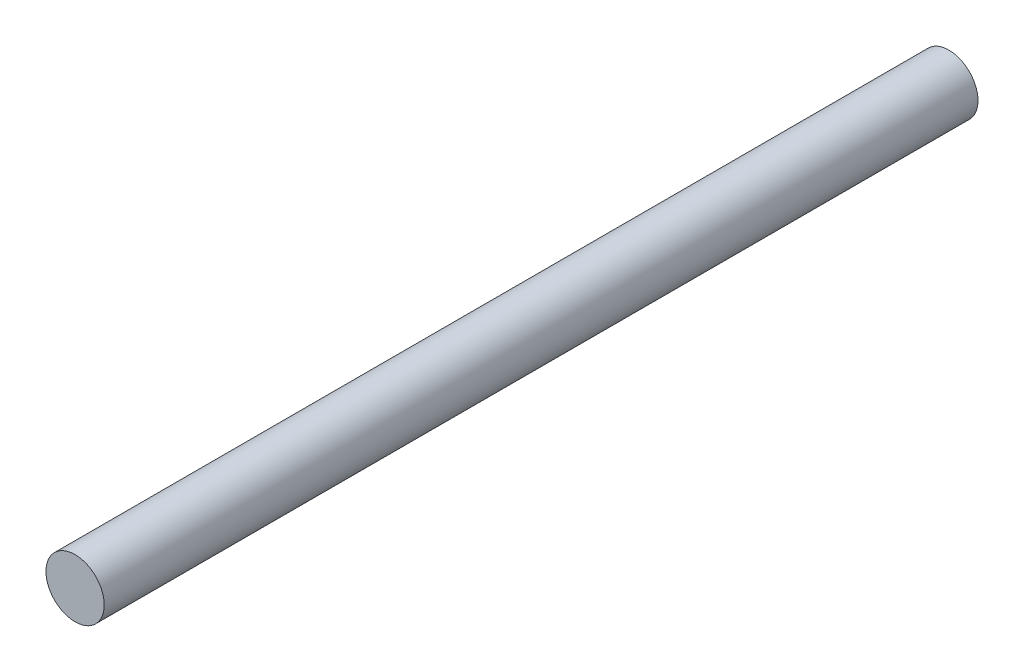
ISO-10303-21;
HEADER;
FILE_DESCRIPTION(('STEP AP214'),'2;1');
FILE_NAME('part.step','',(''),(''),'','','');
FILE_SCHEMA(('AUTOMOTIVE_DESIGN { 1 0 10303 214 1 1 1 1 }'));
ENDSEC;
DATA;
#1=APPLICATION_CONTEXT('core data for automotive mechanical design processes');
#2=APPLICATION_PROTOCOL_DEFINITION('international standard','automotive_design',2000,#1);
#3=PRODUCT_CONTEXT('',#1,'mechanical');
#4=PRODUCT('Part','Part','',(#3));
#5=PRODUCT_RELATED_PRODUCT_CATEGORY('part','',(#4));
#6=PRODUCT_DEFINITION_FORMATION('','',#4);
#7=PRODUCT_DEFINITION_CONTEXT('part definition',#1,'design');
#8=PRODUCT_DEFINITION('design','',#6,#7);
#9=PRODUCT_DEFINITION_SHAPE('','',#8);
#10=(LENGTH_UNIT() NAMED_UNIT(*) SI_UNIT(.MILLI.,.METRE.));
#11=(NAMED_UNIT(*) PLANE_ANGLE_UNIT() SI_UNIT($,.RADIAN.));
#12=(NAMED_UNIT(*) SI_UNIT($,.STERADIAN.) SOLID_ANGLE_UNIT());
#13=UNCERTAINTY_MEASURE_WITH_UNIT(LENGTH_MEASURE(1.E-05),#10,'distance_accuracy_value','');
#14=(GEOMETRIC_REPRESENTATION_CONTEXT(3) GLOBAL_UNCERTAINTY_ASSIGNED_CONTEXT((#13)) GLOBAL_UNIT_ASSIGNED_CONTEXT((#10,
#11,#12)) REPRESENTATION_CONTEXT('',''));
#15=CARTESIAN_POINT('',(0.,0.,0.));
#16=DIRECTION('',(0.,0.,1.));
#17=DIRECTION('',(1.,0.,0.));
#18=AXIS2_PLACEMENT_3D('',#15,#16,#17);
#19=CARTESIAN_POINT('',(0.,0.,75.));
#20=DIRECTION('',(0.,0.,-1.));
#21=DIRECTION('',(-1.,0.,0.));
#22=AXIS2_PLACEMENT_3D('',#19,#20,#21);
#23=CYLINDRICAL_SURFACE('',#22,2.5);
#24=CARTESIAN_POINT('',(0.,0.,75.));
#25=DIRECTION('',(0.,0.,1.));
#26=DIRECTION('',(1.,0.,0.));
#27=AXIS2_PLACEMENT_3D('',#24,#25,#26);
#28=CIRCLE('',#27,2.5);
#29=CARTESIAN_POINT('',(2.5,0.,75.));
#30=VERTEX_POINT('',#29);
#31=EDGE_CURVE('E10',#30,#30,#28,.T.);
#32=ORIENTED_EDGE('',*,*,#31,.F.);
#33=EDGE_LOOP('',(#32));
#34=FACE_BOUND('',#33,.T.);
#35=CARTESIAN_POINT('',(0.,0.,0.));
#36=DIRECTION('',(0.,0.,1.));
#37=DIRECTION('',(1.,0.,0.));
#38=AXIS2_PLACEMENT_3D('',#35,#36,#37);
#39=CIRCLE('',#38,2.5);
#40=CARTESIAN_POINT('',(2.5,0.,0.));
#41=VERTEX_POINT('',#40);
#42=EDGE_CURVE('E38',#41,#41,#39,.T.);
#43=ORIENTED_EDGE('',*,*,#42,.T.);
#44=EDGE_LOOP('',(#43));
#45=FACE_BOUND('',#44,.T.);
#46=ADVANCED_FACE('F35',(#34,#45),#23,.T.);
#47=CARTESIAN_POINT('',(0.,0.,75.));
#48=DIRECTION('',(0.,0.,1.));
#49=DIRECTION('',(1.,0.,0.));
#50=AXIS2_PLACEMENT_3D('',#47,#48,#49);
#51=PLANE('',#50);
#52=ORIENTED_EDGE('',*,*,#31,.T.);
#53=EDGE_LOOP('',(#52));
#54=FACE_BOUND('',#53,.T.);
#55=ADVANCED_FACE('F50',(#54),#51,.T.);
#56=CARTESIAN_POINT('',(0.,0.,0.));
#57=DIRECTION('',(0.,0.,1.));
#58=DIRECTION('',(1.,0.,0.));
#59=AXIS2_PLACEMENT_3D('',#56,#57,#58);
#60=PLANE('',#59);
#61=ORIENTED_EDGE('',*,*,#42,.F.);
#62=EDGE_LOOP('',(#61));
#63=FACE_BOUND('',#62,.T.);
#64=ADVANCED_FACE('F48',(#63),#60,.F.);
#65=CLOSED_SHELL('',(#46,#55,#64));
#66=MANIFOLD_SOLID_BREP('B2',#65);
#67=ADVANCED_BREP_SHAPE_REPRESENTATION('',(#18,#66),#14);
#68=SHAPE_DEFINITION_REPRESENTATION(#9,#67);
ENDSEC;
END-ISO-10303-21;
